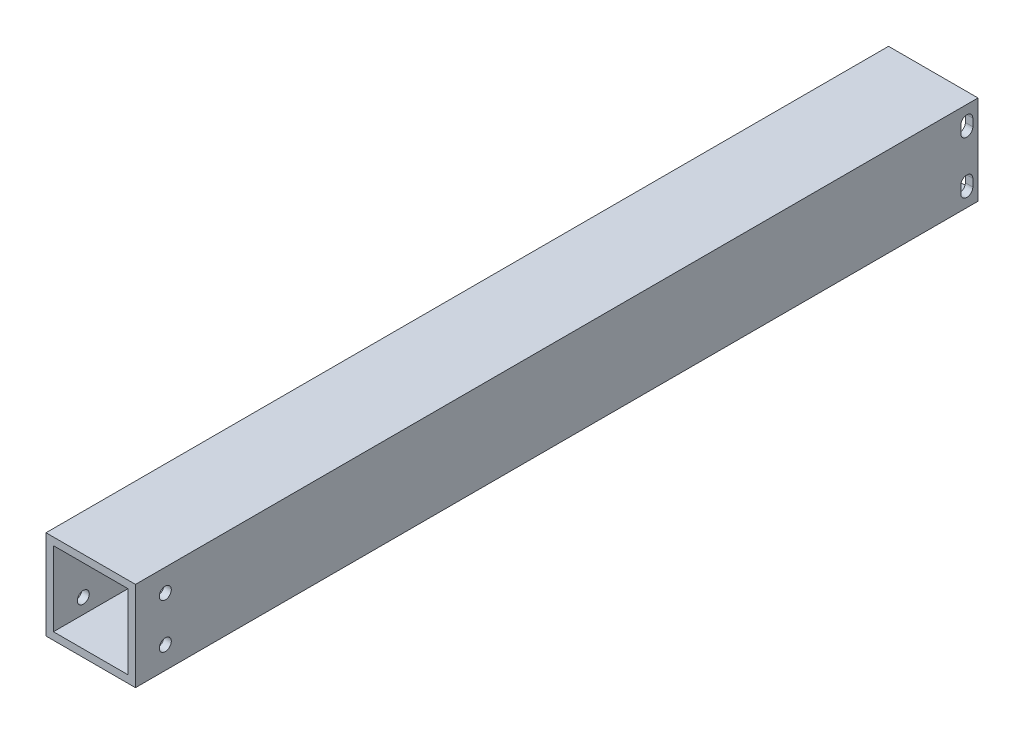
ISO-10303-21;
HEADER;
FILE_DESCRIPTION(('STEP AP214'),'2;1');
FILE_NAME('part.step','',(''),(''),'','','');
FILE_SCHEMA(('AUTOMOTIVE_DESIGN { 1 0 10303 214 1 1 1 1 }'));
ENDSEC;
DATA;
#1=APPLICATION_CONTEXT('core data for automotive mechanical design processes');
#2=APPLICATION_PROTOCOL_DEFINITION('international standard','automotive_design',2000,#1);
#3=PRODUCT_CONTEXT('',#1,'mechanical');
#4=PRODUCT('Part','Part','',(#3));
#5=PRODUCT_RELATED_PRODUCT_CATEGORY('part','',(#4));
#6=PRODUCT_DEFINITION_FORMATION('','',#4);
#7=PRODUCT_DEFINITION_CONTEXT('part definition',#1,'design');
#8=PRODUCT_DEFINITION('design','',#6,#7);
#9=PRODUCT_DEFINITION_SHAPE('','',#8);
#10=(LENGTH_UNIT() NAMED_UNIT(*) SI_UNIT(.MILLI.,.METRE.));
#11=(NAMED_UNIT(*) PLANE_ANGLE_UNIT() SI_UNIT($,.RADIAN.));
#12=(NAMED_UNIT(*) SI_UNIT($,.STERADIAN.) SOLID_ANGLE_UNIT());
#13=UNCERTAINTY_MEASURE_WITH_UNIT(LENGTH_MEASURE(1.E-05),#10,'distance_accuracy_value','');
#14=(GEOMETRIC_REPRESENTATION_CONTEXT(3) GLOBAL_UNCERTAINTY_ASSIGNED_CONTEXT((#13)) GLOBAL_UNIT_ASSIGNED_CONTEXT((#10,
#11,#12)) REPRESENTATION_CONTEXT('',''));
#15=CARTESIAN_POINT('',(0.,0.,0.));
#16=DIRECTION('',(0.,0.,1.));
#17=DIRECTION('',(1.,0.,0.));
#18=AXIS2_PLACEMENT_3D('',#15,#16,#17);
#19=CARTESIAN_POINT('',(0.,31.75,4.7625));
#20=DIRECTION('',(1.,0.,0.));
#21=DIRECTION('',(0.,0.,-1.));
#22=AXIS2_PLACEMENT_3D('',#19,#20,#21);
#23=CYLINDRICAL_SURFACE('',#22,2.5527);
#24=CARTESIAN_POINT('',(0.,31.75,4.7625));
#25=DIRECTION('',(1.,0.,0.));
#26=DIRECTION('',(0.,0.,-1.));
#27=AXIS2_PLACEMENT_3D('',#24,#25,#26);
#28=CIRCLE('',#27,2.5527);
#29=CARTESIAN_POINT('',(0.,31.75,2.2098));
#30=VERTEX_POINT('',#29);
#31=CARTESIAN_POINT('',(0.,31.75,7.31520000000002));
#32=VERTEX_POINT('',#31);
#33=EDGE_CURVE('E274',#30,#32,#28,.T.);
#34=ORIENTED_EDGE('',*,*,#33,.F.);
#35=DIRECTION('',(1.,0.,0.));
#36=VECTOR('',#35,1.);
#37=CARTESIAN_POINT('',(0.,31.75,2.2098));
#38=LINE('',#37,#36);
#39=CARTESIAN_POINT('',(3.1749999999017,31.75,2.2098));
#40=VERTEX_POINT('',#39);
#41=EDGE_CURVE('E188',#30,#40,#38,.T.);
#42=ORIENTED_EDGE('',*,*,#41,.T.);
#43=CARTESIAN_POINT('',(3.1749999999017,31.75,4.7625));
#44=DIRECTION('',(1.,0.,0.));
#45=DIRECTION('',(0.,0.,-1.));
#46=AXIS2_PLACEMENT_3D('',#43,#44,#45);
#47=CIRCLE('',#46,2.5527);
#48=CARTESIAN_POINT('',(3.1749999999017,31.75,7.31520000000001));
#49=VERTEX_POINT('',#48);
#50=EDGE_CURVE('E196',#40,#49,#47,.T.);
#51=ORIENTED_EDGE('',*,*,#50,.T.);
#52=DIRECTION('',(1.,0.,0.));
#53=VECTOR('',#52,1.);
#54=CARTESIAN_POINT('',(0.,31.75,7.31520000000001));
#55=LINE('',#54,#53);
#56=EDGE_CURVE('E217',#49,#32,#55,.F.);
#57=ORIENTED_EDGE('',*,*,#56,.T.);
#58=EDGE_LOOP('',(#34,#42,#51,#57));
#59=FACE_BOUND('',#58,.T.);
#60=ADVANCED_FACE('F17',(#59),#23,.F.);
#61=CARTESIAN_POINT('',(0.,31.75,7.31520000000001));
#62=DIRECTION('',(0.,0.,1.));
#63=DIRECTION('',(0.,-1.,0.));
#64=AXIS2_PLACEMENT_3D('',#61,#62,#63);
#65=PLANE('',#64);
#66=DIRECTION('',(0.,1.,0.));
#67=VECTOR('',#66,1.);
#68=CARTESIAN_POINT('',(0.,38.1,7.31520000000002));
#69=LINE('',#68,#67);
#70=CARTESIAN_POINT('',(0.,28.575,7.31520000000001));
#71=VERTEX_POINT('',#70);
#72=EDGE_CURVE('E273',#32,#71,#69,.F.);
#73=ORIENTED_EDGE('',*,*,#72,.F.);
#74=ORIENTED_EDGE('',*,*,#56,.F.);
#75=DIRECTION('',(0.,-1.,0.));
#76=VECTOR('',#75,1.);
#77=CARTESIAN_POINT('',(3.1749999999017,34.925,7.31520000000001));
#78=LINE('',#77,#76);
#79=CARTESIAN_POINT('',(3.1749999999017,28.575,7.3152));
#80=VERTEX_POINT('',#79);
#81=EDGE_CURVE('E307',#49,#80,#78,.T.);
#82=ORIENTED_EDGE('',*,*,#81,.T.);
#83=DIRECTION('',(1.,0.,0.));
#84=VECTOR('',#83,1.);
#85=CARTESIAN_POINT('',(0.,28.575,7.3152));
#86=LINE('',#85,#84);
#87=EDGE_CURVE('E175',#80,#71,#86,.F.);
#88=ORIENTED_EDGE('',*,*,#87,.T.);
#89=EDGE_LOOP('',(#73,#74,#82,#88));
#90=FACE_BOUND('',#89,.T.);
#91=ADVANCED_FACE('F693',(#90),#65,.F.);
#92=CARTESIAN_POINT('',(0.,28.575,4.7625));
#93=DIRECTION('',(1.,0.,0.));
#94=DIRECTION('',(0.,0.,-1.));
#95=AXIS2_PLACEMENT_3D('',#92,#93,#94);
#96=CYLINDRICAL_SURFACE('',#95,2.5527);
#97=CARTESIAN_POINT('',(0.,28.575,4.7625));
#98=DIRECTION('',(1.,0.,0.));
#99=DIRECTION('',(0.,0.,-1.));
#100=AXIS2_PLACEMENT_3D('',#97,#98,#99);
#101=CIRCLE('',#100,2.5527);
#102=CARTESIAN_POINT('',(0.,28.575,2.20979999999999));
#103=VERTEX_POINT('',#102);
#104=EDGE_CURVE('E271',#71,#103,#101,.T.);
#105=ORIENTED_EDGE('',*,*,#104,.F.);
#106=ORIENTED_EDGE('',*,*,#87,.F.);
#107=CARTESIAN_POINT('',(3.1749999999017,28.575,4.7625));
#108=DIRECTION('',(1.,0.,0.));
#109=DIRECTION('',(0.,0.,-1.));
#110=AXIS2_PLACEMENT_3D('',#107,#108,#109);
#111=CIRCLE('',#110,2.5527);
#112=CARTESIAN_POINT('',(3.1749999999017,28.575,2.2098));
#113=VERTEX_POINT('',#112);
#114=EDGE_CURVE('E20',#80,#113,#111,.T.);
#115=ORIENTED_EDGE('',*,*,#114,.T.);
#116=DIRECTION('',(1.,0.,0.));
#117=VECTOR('',#116,1.);
#118=CARTESIAN_POINT('',(0.,28.575,2.2098));
#119=LINE('',#118,#117);
#120=EDGE_CURVE('E182',#113,#103,#119,.F.);
#121=ORIENTED_EDGE('',*,*,#120,.T.);
#122=EDGE_LOOP('',(#105,#106,#115,#121));
#123=FACE_BOUND('',#122,.T.);
#124=ADVANCED_FACE('F198',(#123),#96,.F.);
#125=CARTESIAN_POINT('',(0.,31.75,2.2098));
#126=DIRECTION('',(0.,0.,-1.));
#127=DIRECTION('',(0.,1.,0.));
#128=AXIS2_PLACEMENT_3D('',#125,#126,#127);
#129=PLANE('',#128);
#130=DIRECTION('',(0.,1.,0.));
#131=VECTOR('',#130,1.);
#132=CARTESIAN_POINT('',(0.,38.1,2.20979999999998));
#133=LINE('',#132,#131);
#134=EDGE_CURVE('E187',#103,#30,#133,.T.);
#135=ORIENTED_EDGE('',*,*,#134,.F.);
#136=ORIENTED_EDGE('',*,*,#120,.F.);
#137=DIRECTION('',(0.,-1.,0.));
#138=VECTOR('',#137,1.);
#139=CARTESIAN_POINT('',(3.1749999999017,34.925,2.2098));
#140=LINE('',#139,#138);
#141=EDGE_CURVE('E185',#113,#40,#140,.F.);
#142=ORIENTED_EDGE('',*,*,#141,.T.);
#143=ORIENTED_EDGE('',*,*,#41,.F.);
#144=EDGE_LOOP('',(#135,#136,#142,#143));
#145=FACE_BOUND('',#144,.T.);
#146=ADVANCED_FACE('F184',(#145),#129,.F.);
#147=CARTESIAN_POINT('',(0.,9.525,346.075));
#148=DIRECTION('',(1.,0.,0.));
#149=DIRECTION('',(0.,0.,-1.));
#150=AXIS2_PLACEMENT_3D('',#147,#148,#149);
#151=CYLINDRICAL_SURFACE('',#150,2.55270000000002);
#152=CARTESIAN_POINT('',(3.1749999999017,9.525,346.075));
#153=DIRECTION('',(1.,0.,0.));
#154=DIRECTION('',(0.,0.,-1.));
#155=AXIS2_PLACEMENT_3D('',#152,#153,#154);
#156=CIRCLE('',#155,2.55270000000002);
#157=CARTESIAN_POINT('',(3.1749999999017,9.525,343.5223));
#158=VERTEX_POINT('',#157);
#159=EDGE_CURVE('E305',#158,#158,#156,.T.);
#160=ORIENTED_EDGE('',*,*,#159,.T.);
#161=EDGE_LOOP('',(#160));
#162=FACE_BOUND('',#161,.T.);
#163=CARTESIAN_POINT('',(0.,9.525,346.075));
#164=DIRECTION('',(1.,0.,0.));
#165=DIRECTION('',(0.,0.,-1.));
#166=AXIS2_PLACEMENT_3D('',#163,#164,#165);
#167=CIRCLE('',#166,2.55270000000002);
#168=CARTESIAN_POINT('',(0.,9.525,343.5223));
#169=VERTEX_POINT('',#168);
#170=EDGE_CURVE('E268',#169,#169,#167,.T.);
#171=ORIENTED_EDGE('',*,*,#170,.F.);
#172=EDGE_LOOP('',(#171));
#173=FACE_BOUND('',#172,.T.);
#174=ADVANCED_FACE('F669',(#162,#173),#151,.F.);
#175=CARTESIAN_POINT('',(0.,28.575,346.075));
#176=DIRECTION('',(1.,0.,0.));
#177=DIRECTION('',(0.,0.,-1.));
#178=AXIS2_PLACEMENT_3D('',#175,#176,#177);
#179=CYLINDRICAL_SURFACE('',#178,2.55270000000002);
#180=CARTESIAN_POINT('',(3.1749999999017,28.575,346.075));
#181=DIRECTION('',(1.,0.,0.));
#182=DIRECTION('',(0.,0.,-1.));
#183=AXIS2_PLACEMENT_3D('',#180,#181,#182);
#184=CIRCLE('',#183,2.55270000000002);
#185=CARTESIAN_POINT('',(3.1749999999017,28.575,343.5223));
#186=VERTEX_POINT('',#185);
#187=EDGE_CURVE('E302',#186,#186,#184,.T.);
#188=ORIENTED_EDGE('',*,*,#187,.T.);
#189=EDGE_LOOP('',(#188));
#190=FACE_BOUND('',#189,.T.);
#191=CARTESIAN_POINT('',(0.,28.575,346.075));
#192=DIRECTION('',(1.,0.,0.));
#193=DIRECTION('',(0.,0.,-1.));
#194=AXIS2_PLACEMENT_3D('',#191,#192,#193);
#195=CIRCLE('',#194,2.55270000000002);
#196=CARTESIAN_POINT('',(0.,28.575,343.5223));
#197=VERTEX_POINT('',#196);
#198=EDGE_CURVE('E265',#197,#197,#195,.T.);
#199=ORIENTED_EDGE('',*,*,#198,.F.);
#200=EDGE_LOOP('',(#199));
#201=FACE_BOUND('',#200,.T.);
#202=ADVANCED_FACE('F661',(#190,#201),#179,.F.);
#203=CARTESIAN_POINT('',(0.,6.34999999999999,4.7625));
#204=DIRECTION('',(1.,0.,0.));
#205=DIRECTION('',(0.,0.,-1.));
#206=AXIS2_PLACEMENT_3D('',#203,#204,#205);
#207=CYLINDRICAL_SURFACE('',#206,2.5527);
#208=CARTESIAN_POINT('',(0.,6.34999999999999,4.7625));
#209=DIRECTION('',(1.,0.,0.));
#210=DIRECTION('',(0.,0.,-1.));
#211=AXIS2_PLACEMENT_3D('',#208,#209,#210);
#212=CIRCLE('',#211,2.5527);
#213=CARTESIAN_POINT('',(0.,6.34999999999999,7.31520000000002));
#214=VERTEX_POINT('',#213);
#215=CARTESIAN_POINT('',(0.,6.34999999999999,2.2098));
#216=VERTEX_POINT('',#215);
#217=EDGE_CURVE('E263',#214,#216,#212,.T.);
#218=ORIENTED_EDGE('',*,*,#217,.F.);
#219=DIRECTION('',(1.,0.,0.));
#220=VECTOR('',#219,1.);
#221=CARTESIAN_POINT('',(0.,6.34999999999999,7.31520000000001));
#222=LINE('',#221,#220);
#223=CARTESIAN_POINT('',(3.1749999999017,6.34999999999999,7.31520000000001));
#224=VERTEX_POINT('',#223);
#225=EDGE_CURVE('E199',#214,#224,#222,.T.);
#226=ORIENTED_EDGE('',*,*,#225,.T.);
#227=CARTESIAN_POINT('',(3.1749999999017,6.34999999999999,4.7625));
#228=DIRECTION('',(1.,0.,0.));
#229=DIRECTION('',(0.,0.,-1.));
#230=AXIS2_PLACEMENT_3D('',#227,#228,#229);
#231=CIRCLE('',#230,2.5527);
#232=CARTESIAN_POINT('',(3.1749999999017,6.34999999999999,2.2098));
#233=VERTEX_POINT('',#232);
#234=EDGE_CURVE('E295',#224,#233,#231,.T.);
#235=ORIENTED_EDGE('',*,*,#234,.T.);
#236=DIRECTION('',(1.,0.,0.));
#237=VECTOR('',#236,1.);
#238=CARTESIAN_POINT('',(0.,6.34999999999999,2.2098));
#239=LINE('',#238,#237);
#240=EDGE_CURVE('E212',#233,#216,#239,.F.);
#241=ORIENTED_EDGE('',*,*,#240,.T.);
#242=EDGE_LOOP('',(#218,#226,#235,#241));
#243=FACE_BOUND('',#242,.T.);
#244=ADVANCED_FACE('F652',(#243),#207,.F.);
#245=CARTESIAN_POINT('',(0.,6.34999999999999,2.2098));
#246=DIRECTION('',(0.,0.,-1.));
#247=DIRECTION('',(0.,1.,0.));
#248=AXIS2_PLACEMENT_3D('',#245,#246,#247);
#249=PLANE('',#248);
#250=DIRECTION('',(0.,1.,0.));
#251=VECTOR('',#250,1.);
#252=CARTESIAN_POINT('',(0.,38.1,2.20979999999998));
#253=LINE('',#252,#251);
#254=CARTESIAN_POINT('',(0.,9.525,2.20979999999999));
#255=VERTEX_POINT('',#254);
#256=EDGE_CURVE('E262',#216,#255,#253,.T.);
#257=ORIENTED_EDGE('',*,*,#256,.F.);
#258=ORIENTED_EDGE('',*,*,#240,.F.);
#259=DIRECTION('',(0.,-1.,0.));
#260=VECTOR('',#259,1.);
#261=CARTESIAN_POINT('',(3.1749999999017,34.925,2.2098));
#262=LINE('',#261,#260);
#263=CARTESIAN_POINT('',(3.1749999999017,9.525,2.2098));
#264=VERTEX_POINT('',#263);
#265=EDGE_CURVE('E297',#233,#264,#262,.F.);
#266=ORIENTED_EDGE('',*,*,#265,.T.);
#267=DIRECTION('',(1.,0.,0.));
#268=VECTOR('',#267,1.);
#269=CARTESIAN_POINT('',(0.,9.525,2.2098));
#270=LINE('',#269,#268);
#271=EDGE_CURVE('E207',#264,#255,#270,.F.);
#272=ORIENTED_EDGE('',*,*,#271,.T.);
#273=EDGE_LOOP('',(#257,#258,#266,#272));
#274=FACE_BOUND('',#273,.T.);
#275=ADVANCED_FACE('F643',(#274),#249,.F.);
#276=CARTESIAN_POINT('',(0.,9.525,4.7625));
#277=DIRECTION('',(1.,0.,0.));
#278=DIRECTION('',(0.,0.,-1.));
#279=AXIS2_PLACEMENT_3D('',#276,#277,#278);
#280=CYLINDRICAL_SURFACE('',#279,2.5527);
#281=CARTESIAN_POINT('',(0.,9.525,4.7625));
#282=DIRECTION('',(1.,0.,0.));
#283=DIRECTION('',(0.,0.,-1.));
#284=AXIS2_PLACEMENT_3D('',#281,#282,#283);
#285=CIRCLE('',#284,2.5527);
#286=CARTESIAN_POINT('',(0.,9.525,7.31520000000002));
#287=VERTEX_POINT('',#286);
#288=EDGE_CURVE('E259',#255,#287,#285,.T.);
#289=ORIENTED_EDGE('',*,*,#288,.F.);
#290=ORIENTED_EDGE('',*,*,#271,.F.);
#291=CARTESIAN_POINT('',(3.1749999999017,9.525,4.7625));
#292=DIRECTION('',(1.,0.,0.));
#293=DIRECTION('',(0.,0.,-1.));
#294=AXIS2_PLACEMENT_3D('',#291,#292,#293);
#295=CIRCLE('',#294,2.5527);
#296=CARTESIAN_POINT('',(3.1749999999017,9.525,7.31520000000001));
#297=VERTEX_POINT('',#296);
#298=EDGE_CURVE('E299',#264,#297,#295,.T.);
#299=ORIENTED_EDGE('',*,*,#298,.T.);
#300=DIRECTION('',(1.,0.,0.));
#301=VECTOR('',#300,1.);
#302=CARTESIAN_POINT('',(0.,9.525,7.31520000000001));
#303=LINE('',#302,#301);
#304=EDGE_CURVE('E200',#297,#287,#303,.F.);
#305=ORIENTED_EDGE('',*,*,#304,.T.);
#306=EDGE_LOOP('',(#289,#290,#299,#305));
#307=FACE_BOUND('',#306,.T.);
#308=ADVANCED_FACE('F634',(#307),#280,.F.);
#309=CARTESIAN_POINT('',(0.,6.34999999999999,7.31520000000001));
#310=DIRECTION('',(0.,0.,1.));
#311=DIRECTION('',(0.,-1.,0.));
#312=AXIS2_PLACEMENT_3D('',#309,#310,#311);
#313=PLANE('',#312);
#314=DIRECTION('',(0.,1.,0.));
#315=VECTOR('',#314,1.);
#316=CARTESIAN_POINT('',(0.,38.1,7.31520000000002));
#317=LINE('',#316,#315);
#318=EDGE_CURVE('E261',#287,#214,#317,.F.);
#319=ORIENTED_EDGE('',*,*,#318,.F.);
#320=ORIENTED_EDGE('',*,*,#304,.F.);
#321=DIRECTION('',(0.,-1.,0.));
#322=VECTOR('',#321,1.);
#323=CARTESIAN_POINT('',(3.1749999999017,34.925,7.31520000000001));
#324=LINE('',#323,#322);
#325=EDGE_CURVE('E298',#297,#224,#324,.T.);
#326=ORIENTED_EDGE('',*,*,#325,.T.);
#327=ORIENTED_EDGE('',*,*,#225,.F.);
#328=EDGE_LOOP('',(#319,#320,#326,#327));
#329=FACE_BOUND('',#328,.T.);
#330=ADVANCED_FACE('F625',(#329),#313,.F.);
#331=CARTESIAN_POINT('',(3.1749999999017,34.925,0.));
#332=DIRECTION('',(-1.,0.,0.));
#333=DIRECTION('',(0.,-1.,0.));
#334=AXIS2_PLACEMENT_3D('',#331,#332,#333);
#335=PLANE('',#334);
#336=DIRECTION('',(0.,0.,-1.));
#337=VECTOR('',#336,1.);
#338=CARTESIAN_POINT('',(3.1749999999017,3.17499999992628,0.));
#339=LINE('',#338,#337);
#340=CARTESIAN_POINT('',(3.1749999999017,3.17499999992628,358.775));
#341=VERTEX_POINT('',#340);
#342=CARTESIAN_POINT('',(3.1749999999017,3.17499999992628,0.));
#343=VERTEX_POINT('',#342);
#344=EDGE_CURVE('E316',#341,#343,#339,.T.);
#345=ORIENTED_EDGE('',*,*,#344,.T.);
#346=DIRECTION('',(0.,1.,0.));
#347=VECTOR('',#346,1.);
#348=CARTESIAN_POINT('',(3.1749999999017,38.1,0.));
#349=LINE('',#348,#347);
#350=CARTESIAN_POINT('',(3.1749999999017,34.925,0.));
#351=VERTEX_POINT('',#350);
#352=EDGE_CURVE('E365',#351,#343,#349,.F.);
#353=ORIENTED_EDGE('',*,*,#352,.F.);
#354=DIRECTION('',(0.,0.,1.));
#355=VECTOR('',#354,1.);
#356=CARTESIAN_POINT('',(3.1749999999017,34.925,0.));
#357=LINE('',#356,#355);
#358=CARTESIAN_POINT('',(3.1749999999017,34.925,358.775));
#359=VERTEX_POINT('',#358);
#360=EDGE_CURVE('E294',#351,#359,#357,.T.);
#361=ORIENTED_EDGE('',*,*,#360,.T.);
#362=DIRECTION('',(0.,1.,0.));
#363=VECTOR('',#362,1.);
#364=CARTESIAN_POINT('',(3.1749999999017,38.1,358.775));
#365=LINE('',#364,#363);
#366=EDGE_CURVE('E342',#341,#359,#365,.T.);
#367=ORIENTED_EDGE('',*,*,#366,.F.);
#368=EDGE_LOOP('',(#345,#353,#361,#367));
#369=FACE_BOUND('',#368,.T.);
#370=ORIENTED_EDGE('',*,*,#234,.F.);
#371=ORIENTED_EDGE('',*,*,#325,.F.);
#372=ORIENTED_EDGE('',*,*,#298,.F.);
#373=ORIENTED_EDGE('',*,*,#265,.F.);
#374=EDGE_LOOP('',(#370,#371,#372,#373));
#375=FACE_BOUND('',#374,.T.);
#376=ORIENTED_EDGE('',*,*,#187,.F.);
#377=EDGE_LOOP('',(#376));
#378=FACE_BOUND('',#377,.T.);
#379=ORIENTED_EDGE('',*,*,#159,.F.);
#380=EDGE_LOOP('',(#379));
#381=FACE_BOUND('',#380,.T.);
#382=ORIENTED_EDGE('',*,*,#50,.F.);
#383=ORIENTED_EDGE('',*,*,#141,.F.);
#384=ORIENTED_EDGE('',*,*,#114,.F.);
#385=ORIENTED_EDGE('',*,*,#81,.F.);
#386=EDGE_LOOP('',(#382,#383,#384,#385));
#387=FACE_BOUND('',#386,.T.);
#388=ADVANCED_FACE('F192',(#369,#375,#378,#381,#387),#335,.F.);
#389=CARTESIAN_POINT('',(3.1749999999017,3.17499999992628,0.));
#390=DIRECTION('',(0.,-1.,0.));
#391=DIRECTION('',(0.,0.,-1.));
#392=AXIS2_PLACEMENT_3D('',#389,#390,#391);
#393=PLANE('',#392);
#394=DIRECTION('',(0.,0.,1.));
#395=VECTOR('',#394,1.);
#396=CARTESIAN_POINT('',(34.925,3.17499999992628,0.));
#397=LINE('',#396,#395);
#398=CARTESIAN_POINT('',(34.925,3.17499999992628,358.775));
#399=VERTEX_POINT('',#398);
#400=CARTESIAN_POINT('',(34.925,3.17499999992628,0.));
#401=VERTEX_POINT('',#400);
#402=EDGE_CURVE('E319',#399,#401,#397,.F.);
#403=ORIENTED_EDGE('',*,*,#402,.T.);
#404=DIRECTION('',(-1.,0.,0.));
#405=VECTOR('',#404,1.);
#406=CARTESIAN_POINT('',(0.,3.17499999992628,0.));
#407=LINE('',#406,#405);
#408=EDGE_CURVE('E367',#343,#401,#407,.F.);
#409=ORIENTED_EDGE('',*,*,#408,.F.);
#410=ORIENTED_EDGE('',*,*,#344,.F.);
#411=DIRECTION('',(1.,0.,0.));
#412=VECTOR('',#411,1.);
#413=CARTESIAN_POINT('',(38.1,3.17499999992628,358.775));
#414=LINE('',#413,#412);
#415=EDGE_CURVE('E352',#399,#341,#414,.F.);
#416=ORIENTED_EDGE('',*,*,#415,.F.);
#417=EDGE_LOOP('',(#403,#409,#410,#416));
#418=FACE_BOUND('',#417,.T.);
#419=ADVANCED_FACE('F444',(#418),#393,.F.);
#420=CARTESIAN_POINT('',(34.925,3.17499999992628,0.));
#421=DIRECTION('',(1.,0.,0.));
#422=DIRECTION('',(0.,1.,0.));
#423=AXIS2_PLACEMENT_3D('',#420,#421,#422);
#424=PLANE('',#423);
#425=DIRECTION('',(0.,0.,1.));
#426=VECTOR('',#425,1.);
#427=CARTESIAN_POINT('',(34.925,34.925,0.));
#428=LINE('',#427,#426);
#429=CARTESIAN_POINT('',(34.925,34.925,358.775));
#430=VERTEX_POINT('',#429);
#431=CARTESIAN_POINT('',(34.925,34.925,0.));
#432=VERTEX_POINT('',#431);
#433=EDGE_CURVE('E322',#430,#432,#428,.F.);
#434=ORIENTED_EDGE('',*,*,#433,.T.);
#435=DIRECTION('',(0.,1.,0.));
#436=VECTOR('',#435,1.);
#437=CARTESIAN_POINT('',(34.925,38.1,0.));
#438=LINE('',#437,#436);
#439=EDGE_CURVE('E369',#401,#432,#438,.T.);
#440=ORIENTED_EDGE('',*,*,#439,.F.);
#441=ORIENTED_EDGE('',*,*,#402,.F.);
#442=DIRECTION('',(0.,1.,0.));
#443=VECTOR('',#442,1.);
#444=CARTESIAN_POINT('',(34.925,38.1,358.775));
#445=LINE('',#444,#443);
#446=EDGE_CURVE('E349',#430,#399,#445,.F.);
#447=ORIENTED_EDGE('',*,*,#446,.F.);
#448=EDGE_LOOP('',(#434,#440,#441,#447));
#449=FACE_BOUND('',#448,.T.);
#450=CARTESIAN_POINT('',(34.925,6.34999999999999,4.7625));
#451=DIRECTION('',(1.,0.,0.));
#452=DIRECTION('',(0.,0.,-1.));
#453=AXIS2_PLACEMENT_3D('',#450,#451,#452);
#454=CIRCLE('',#453,2.5527);
#455=CARTESIAN_POINT('',(34.925,6.34999999999999,7.31520000000001));
#456=VERTEX_POINT('',#455);
#457=CARTESIAN_POINT('',(34.925,6.34999999999999,2.2098));
#458=VERTEX_POINT('',#457);
#459=EDGE_CURVE('E229',#456,#458,#454,.T.);
#460=ORIENTED_EDGE('',*,*,#459,.T.);
#461=DIRECTION('',(0.,1.,0.));
#462=VECTOR('',#461,1.);
#463=CARTESIAN_POINT('',(34.925,6.34999999999999,2.2098));
#464=LINE('',#463,#462);
#465=CARTESIAN_POINT('',(34.925,9.525,2.2098));
#466=VERTEX_POINT('',#465);
#467=EDGE_CURVE('E220',#458,#466,#464,.T.);
#468=ORIENTED_EDGE('',*,*,#467,.T.);
#469=CARTESIAN_POINT('',(34.925,9.525,4.7625));
#470=DIRECTION('',(1.,0.,0.));
#471=DIRECTION('',(0.,0.,-1.));
#472=AXIS2_PLACEMENT_3D('',#469,#470,#471);
#473=CIRCLE('',#472,2.5527);
#474=CARTESIAN_POINT('',(34.925,9.525,7.31520000000001));
#475=VERTEX_POINT('',#474);
#476=EDGE_CURVE('E277',#466,#475,#473,.T.);
#477=ORIENTED_EDGE('',*,*,#476,.T.);
#478=DIRECTION('',(0.,-1.,0.));
#479=VECTOR('',#478,1.);
#480=CARTESIAN_POINT('',(34.925,6.34999999999999,7.31520000000001));
#481=LINE('',#480,#479);
#482=EDGE_CURVE('E225',#475,#456,#481,.T.);
#483=ORIENTED_EDGE('',*,*,#482,.T.);
#484=EDGE_LOOP('',(#460,#468,#477,#483));
#485=FACE_BOUND('',#484,.T.);
#486=CARTESIAN_POINT('',(34.925,28.575,346.075));
#487=DIRECTION('',(1.,0.,0.));
#488=DIRECTION('',(0.,0.,-1.));
#489=AXIS2_PLACEMENT_3D('',#486,#487,#488);
#490=CIRCLE('',#489,2.55270000000002);
#491=CARTESIAN_POINT('',(34.925,28.575,343.5223));
#492=VERTEX_POINT('',#491);
#493=EDGE_CURVE('E282',#492,#492,#490,.T.);
#494=ORIENTED_EDGE('',*,*,#493,.T.);
#495=EDGE_LOOP('',(#494));
#496=FACE_BOUND('',#495,.T.);
#497=CARTESIAN_POINT('',(34.925,9.525,346.075));
#498=DIRECTION('',(1.,0.,0.));
#499=DIRECTION('',(0.,0.,-1.));
#500=AXIS2_PLACEMENT_3D('',#497,#498,#499);
#501=CIRCLE('',#500,2.55270000000002);
#502=CARTESIAN_POINT('',(34.925,9.525,343.5223));
#503=VERTEX_POINT('',#502);
#504=EDGE_CURVE('E285',#503,#503,#501,.T.);
#505=ORIENTED_EDGE('',*,*,#504,.T.);
#506=EDGE_LOOP('',(#505));
#507=FACE_BOUND('',#506,.T.);
#508=CARTESIAN_POINT('',(34.925,31.75,4.7625));
#509=DIRECTION('',(1.,0.,0.));
#510=DIRECTION('',(0.,0.,-1.));
#511=AXIS2_PLACEMENT_3D('',#508,#509,#510);
#512=CIRCLE('',#511,2.5527);
#513=CARTESIAN_POINT('',(34.925,31.75,2.2098));
#514=VERTEX_POINT('',#513);
#515=CARTESIAN_POINT('',(34.925,31.75,7.31520000000001));
#516=VERTEX_POINT('',#515);
#517=EDGE_CURVE('E239',#514,#516,#512,.T.);
#518=ORIENTED_EDGE('',*,*,#517,.T.);
#519=DIRECTION('',(0.,-1.,0.));
#520=VECTOR('',#519,1.);
#521=CARTESIAN_POINT('',(34.925,31.75,7.31520000000001));
#522=LINE('',#521,#520);
#523=CARTESIAN_POINT('',(34.925,28.575,7.31520000000001));
#524=VERTEX_POINT('',#523);
#525=EDGE_CURVE('E230',#516,#524,#522,.T.);
#526=ORIENTED_EDGE('',*,*,#525,.T.);
#527=CARTESIAN_POINT('',(34.925,28.575,4.7625));
#528=DIRECTION('',(1.,0.,0.));
#529=DIRECTION('',(0.,0.,-1.));
#530=AXIS2_PLACEMENT_3D('',#527,#528,#529);
#531=CIRCLE('',#530,2.5527);
#532=CARTESIAN_POINT('',(34.925,28.575,2.2098));
#533=VERTEX_POINT('',#532);
#534=EDGE_CURVE('E289',#524,#533,#531,.T.);
#535=ORIENTED_EDGE('',*,*,#534,.T.);
#536=DIRECTION('',(0.,1.,0.));
#537=VECTOR('',#536,1.);
#538=CARTESIAN_POINT('',(34.925,31.75,2.2098));
#539=LINE('',#538,#537);
#540=EDGE_CURVE('E235',#533,#514,#539,.T.);
#541=ORIENTED_EDGE('',*,*,#540,.T.);
#542=EDGE_LOOP('',(#518,#526,#535,#541));
#543=FACE_BOUND('',#542,.T.);
#544=ADVANCED_FACE('F441',(#449,#485,#496,#507,#543),#424,.F.);
#545=CARTESIAN_POINT('',(34.925,34.925,0.));
#546=DIRECTION('',(0.,1.,0.));
#547=DIRECTION('',(0.,0.,1.));
#548=AXIS2_PLACEMENT_3D('',#545,#546,#547);
#549=PLANE('',#548);
#550=ORIENTED_EDGE('',*,*,#360,.F.);
#551=DIRECTION('',(-1.,0.,0.));
#552=VECTOR('',#551,1.);
#553=CARTESIAN_POINT('',(0.,34.925,0.));
#554=LINE('',#553,#552);
#555=EDGE_CURVE('E371',#432,#351,#554,.T.);
#556=ORIENTED_EDGE('',*,*,#555,.F.);
#557=ORIENTED_EDGE('',*,*,#433,.F.);
#558=DIRECTION('',(1.,0.,0.));
#559=VECTOR('',#558,1.);
#560=CARTESIAN_POINT('',(38.1,34.925,358.775));
#561=LINE('',#560,#559);
#562=EDGE_CURVE('E346',#359,#430,#561,.T.);
#563=ORIENTED_EDGE('',*,*,#562,.F.);
#564=EDGE_LOOP('',(#550,#556,#557,#563));
#565=FACE_BOUND('',#564,.T.);
#566=ADVANCED_FACE('F443',(#565),#549,.F.);
#567=CARTESIAN_POINT('',(0.,31.75,4.7625));
#568=DIRECTION('',(1.,0.,0.));
#569=DIRECTION('',(0.,0.,-1.));
#570=AXIS2_PLACEMENT_3D('',#567,#568,#569);
#571=CYLINDRICAL_SURFACE('',#570,2.5527);
#572=CARTESIAN_POINT('',(38.1,31.75,4.7625));
#573=DIRECTION('',(1.,0.,0.));
#574=DIRECTION('',(0.,0.,-1.));
#575=AXIS2_PLACEMENT_3D('',#572,#573,#574);
#576=CIRCLE('',#575,2.5527);
#577=CARTESIAN_POINT('',(38.1,31.75,7.31520000000001));
#578=VERTEX_POINT('',#577);
#579=CARTESIAN_POINT('',(38.1,31.75,2.2098));
#580=VERTEX_POINT('',#579);
#581=EDGE_CURVE('E256',#578,#580,#576,.F.);
#582=ORIENTED_EDGE('',*,*,#581,.F.);
#583=DIRECTION('',(1.,0.,0.));
#584=VECTOR('',#583,1.);
#585=CARTESIAN_POINT('',(0.,31.75,7.31520000000001));
#586=LINE('',#585,#584);
#587=EDGE_CURVE('E288',#578,#516,#586,.F.);
#588=ORIENTED_EDGE('',*,*,#587,.T.);
#589=ORIENTED_EDGE('',*,*,#517,.F.);
#590=DIRECTION('',(1.,0.,0.));
#591=VECTOR('',#590,1.);
#592=CARTESIAN_POINT('',(0.,31.75,2.2098));
#593=LINE('',#592,#591);
#594=EDGE_CURVE('E238',#514,#580,#593,.T.);
#595=ORIENTED_EDGE('',*,*,#594,.T.);
#596=EDGE_LOOP('',(#582,#588,#589,#595));
#597=FACE_BOUND('',#596,.T.);
#598=ADVANCED_FACE('F436',(#597),#571,.F.);
#599=CARTESIAN_POINT('',(0.,31.75,2.2098));
#600=DIRECTION('',(0.,0.,-1.));
#601=DIRECTION('',(0.,1.,0.));
#602=AXIS2_PLACEMENT_3D('',#599,#600,#601);
#603=PLANE('',#602);
#604=DIRECTION('',(0.,1.,0.));
#605=VECTOR('',#604,1.);
#606=CARTESIAN_POINT('',(38.1,38.1,2.2098));
#607=LINE('',#606,#605);
#608=CARTESIAN_POINT('',(38.1,28.575,2.2098));
#609=VERTEX_POINT('',#608);
#610=EDGE_CURVE('E255',#580,#609,#607,.F.);
#611=ORIENTED_EDGE('',*,*,#610,.F.);
#612=ORIENTED_EDGE('',*,*,#594,.F.);
#613=ORIENTED_EDGE('',*,*,#540,.F.);
#614=DIRECTION('',(1.,0.,0.));
#615=VECTOR('',#614,1.);
#616=CARTESIAN_POINT('',(0.,28.575,2.2098));
#617=LINE('',#616,#615);
#618=EDGE_CURVE('E234',#533,#609,#617,.T.);
#619=ORIENTED_EDGE('',*,*,#618,.T.);
#620=EDGE_LOOP('',(#611,#612,#613,#619));
#621=FACE_BOUND('',#620,.T.);
#622=ADVANCED_FACE('F439',(#621),#603,.F.);
#623=CARTESIAN_POINT('',(0.,28.575,4.7625));
#624=DIRECTION('',(1.,0.,0.));
#625=DIRECTION('',(0.,0.,-1.));
#626=AXIS2_PLACEMENT_3D('',#623,#624,#625);
#627=CYLINDRICAL_SURFACE('',#626,2.5527);
#628=CARTESIAN_POINT('',(38.1,28.575,4.7625));
#629=DIRECTION('',(1.,0.,0.));
#630=DIRECTION('',(0.,0.,-1.));
#631=AXIS2_PLACEMENT_3D('',#628,#629,#630);
#632=CIRCLE('',#631,2.5527);
#633=CARTESIAN_POINT('',(38.1,28.575,7.31520000000001));
#634=VERTEX_POINT('',#633);
#635=EDGE_CURVE('E253',#609,#634,#632,.F.);
#636=ORIENTED_EDGE('',*,*,#635,.F.);
#637=ORIENTED_EDGE('',*,*,#618,.F.);
#638=ORIENTED_EDGE('',*,*,#534,.F.);
#639=DIRECTION('',(1.,0.,0.));
#640=VECTOR('',#639,1.);
#641=CARTESIAN_POINT('',(0.,28.575,7.31520000000001));
#642=LINE('',#641,#640);
#643=EDGE_CURVE('E233',#524,#634,#642,.T.);
#644=ORIENTED_EDGE('',*,*,#643,.T.);
#645=EDGE_LOOP('',(#636,#637,#638,#644));
#646=FACE_BOUND('',#645,.T.);
#647=ADVANCED_FACE('F432',(#646),#627,.F.);
#648=CARTESIAN_POINT('',(0.,31.75,7.31520000000001));
#649=DIRECTION('',(0.,0.,1.));
#650=DIRECTION('',(0.,-1.,0.));
#651=AXIS2_PLACEMENT_3D('',#648,#649,#650);
#652=PLANE('',#651);
#653=DIRECTION('',(0.,1.,0.));
#654=VECTOR('',#653,1.);
#655=CARTESIAN_POINT('',(38.1,38.1,7.31520000000001));
#656=LINE('',#655,#654);
#657=EDGE_CURVE('E252',#634,#578,#656,.T.);
#658=ORIENTED_EDGE('',*,*,#657,.F.);
#659=ORIENTED_EDGE('',*,*,#643,.F.);
#660=ORIENTED_EDGE('',*,*,#525,.F.);
#661=ORIENTED_EDGE('',*,*,#587,.F.);
#662=EDGE_LOOP('',(#658,#659,#660,#661));
#663=FACE_BOUND('',#662,.T.);
#664=ADVANCED_FACE('F434',(#663),#652,.F.);
#665=CARTESIAN_POINT('',(0.,9.525,346.075));
#666=DIRECTION('',(1.,0.,0.));
#667=DIRECTION('',(0.,0.,-1.));
#668=AXIS2_PLACEMENT_3D('',#665,#666,#667);
#669=CYLINDRICAL_SURFACE('',#668,2.55270000000002);
#670=CARTESIAN_POINT('',(38.1,9.525,346.075));
#671=DIRECTION('',(1.,0.,0.));
#672=DIRECTION('',(0.,0.,-1.));
#673=AXIS2_PLACEMENT_3D('',#670,#671,#672);
#674=CIRCLE('',#673,2.55270000000002);
#675=CARTESIAN_POINT('',(38.1,9.525,343.5223));
#676=VERTEX_POINT('',#675);
#677=EDGE_CURVE('E249',#676,#676,#674,.F.);
#678=ORIENTED_EDGE('',*,*,#677,.F.);
#679=EDGE_LOOP('',(#678));
#680=FACE_BOUND('',#679,.T.);
#681=ORIENTED_EDGE('',*,*,#504,.F.);
#682=EDGE_LOOP('',(#681));
#683=FACE_BOUND('',#682,.T.);
#684=ADVANCED_FACE('F491',(#680,#683),#669,.F.);
#685=CARTESIAN_POINT('',(0.,28.575,346.075));
#686=DIRECTION('',(1.,0.,0.));
#687=DIRECTION('',(0.,0.,-1.));
#688=AXIS2_PLACEMENT_3D('',#685,#686,#687);
#689=CYLINDRICAL_SURFACE('',#688,2.55270000000002);
#690=CARTESIAN_POINT('',(38.1,28.575,346.075));
#691=DIRECTION('',(1.,0.,0.));
#692=DIRECTION('',(0.,0.,-1.));
#693=AXIS2_PLACEMENT_3D('',#690,#691,#692);
#694=CIRCLE('',#693,2.55270000000002);
#695=CARTESIAN_POINT('',(38.1,28.575,343.5223));
#696=VERTEX_POINT('',#695);
#697=EDGE_CURVE('E246',#696,#696,#694,.F.);
#698=ORIENTED_EDGE('',*,*,#697,.F.);
#699=EDGE_LOOP('',(#698));
#700=FACE_BOUND('',#699,.T.);
#701=ORIENTED_EDGE('',*,*,#493,.F.);
#702=EDGE_LOOP('',(#701));
#703=FACE_BOUND('',#702,.T.);
#704=ADVANCED_FACE('F487',(#700,#703),#689,.F.);
#705=CARTESIAN_POINT('',(0.,6.34999999999999,4.7625));
#706=DIRECTION('',(1.,0.,0.));
#707=DIRECTION('',(0.,0.,-1.));
#708=AXIS2_PLACEMENT_3D('',#705,#706,#707);
#709=CYLINDRICAL_SURFACE('',#708,2.5527);
#710=CARTESIAN_POINT('',(38.1,6.34999999999999,4.7625));
#711=DIRECTION('',(1.,0.,0.));
#712=DIRECTION('',(0.,0.,-1.));
#713=AXIS2_PLACEMENT_3D('',#710,#711,#712);
#714=CIRCLE('',#713,2.5527);
#715=CARTESIAN_POINT('',(38.1,6.34999999999999,2.2098));
#716=VERTEX_POINT('',#715);
#717=CARTESIAN_POINT('',(38.1,6.34999999999999,7.31520000000001));
#718=VERTEX_POINT('',#717);
#719=EDGE_CURVE('E244',#716,#718,#714,.F.);
#720=ORIENTED_EDGE('',*,*,#719,.F.);
#721=DIRECTION('',(1.,0.,0.));
#722=VECTOR('',#721,1.);
#723=CARTESIAN_POINT('',(0.,6.34999999999999,2.2098));
#724=LINE('',#723,#722);
#725=EDGE_CURVE('E339',#716,#458,#724,.F.);
#726=ORIENTED_EDGE('',*,*,#725,.T.);
#727=ORIENTED_EDGE('',*,*,#459,.F.);
#728=DIRECTION('',(1.,0.,0.));
#729=VECTOR('',#728,1.);
#730=CARTESIAN_POINT('',(0.,6.34999999999999,7.31520000000001));
#731=LINE('',#730,#729);
#732=EDGE_CURVE('E228',#456,#718,#731,.T.);
#733=ORIENTED_EDGE('',*,*,#732,.T.);
#734=EDGE_LOOP('',(#720,#726,#727,#733));
#735=FACE_BOUND('',#734,.T.);
#736=ADVANCED_FACE('F483',(#735),#709,.F.);
#737=CARTESIAN_POINT('',(0.,6.34999999999999,7.31520000000001));
#738=DIRECTION('',(0.,0.,1.));
#739=DIRECTION('',(0.,-1.,0.));
#740=AXIS2_PLACEMENT_3D('',#737,#738,#739);
#741=PLANE('',#740);
#742=DIRECTION('',(0.,1.,0.));
#743=VECTOR('',#742,1.);
#744=CARTESIAN_POINT('',(38.1,38.1,7.31520000000001));
#745=LINE('',#744,#743);
#746=CARTESIAN_POINT('',(38.1,9.525,7.3152));
#747=VERTEX_POINT('',#746);
#748=EDGE_CURVE('E243',#718,#747,#745,.T.);
#749=ORIENTED_EDGE('',*,*,#748,.F.);
#750=ORIENTED_EDGE('',*,*,#732,.F.);
#751=ORIENTED_EDGE('',*,*,#482,.F.);
#752=DIRECTION('',(1.,0.,0.));
#753=VECTOR('',#752,1.);
#754=CARTESIAN_POINT('',(0.,9.525,7.3152));
#755=LINE('',#754,#753);
#756=EDGE_CURVE('E224',#475,#747,#755,.T.);
#757=ORIENTED_EDGE('',*,*,#756,.T.);
#758=EDGE_LOOP('',(#749,#750,#751,#757));
#759=FACE_BOUND('',#758,.T.);
#760=ADVANCED_FACE('F479',(#759),#741,.F.);
#761=CARTESIAN_POINT('',(0.,9.525,4.7625));
#762=DIRECTION('',(1.,0.,0.));
#763=DIRECTION('',(0.,0.,-1.));
#764=AXIS2_PLACEMENT_3D('',#761,#762,#763);
#765=CYLINDRICAL_SURFACE('',#764,2.5527);
#766=CARTESIAN_POINT('',(38.1,9.525,4.7625));
#767=DIRECTION('',(1.,0.,0.));
#768=DIRECTION('',(0.,0.,-1.));
#769=AXIS2_PLACEMENT_3D('',#766,#767,#768);
#770=CIRCLE('',#769,2.5527);
#771=CARTESIAN_POINT('',(38.1,9.525,2.2098));
#772=VERTEX_POINT('',#771);
#773=EDGE_CURVE('E240',#747,#772,#770,.F.);
#774=ORIENTED_EDGE('',*,*,#773,.F.);
#775=ORIENTED_EDGE('',*,*,#756,.F.);
#776=ORIENTED_EDGE('',*,*,#476,.F.);
#777=DIRECTION('',(1.,0.,0.));
#778=VECTOR('',#777,1.);
#779=CARTESIAN_POINT('',(0.,9.525,2.2098));
#780=LINE('',#779,#778);
#781=EDGE_CURVE('E223',#466,#772,#780,.T.);
#782=ORIENTED_EDGE('',*,*,#781,.T.);
#783=EDGE_LOOP('',(#774,#775,#776,#782));
#784=FACE_BOUND('',#783,.T.);
#785=ADVANCED_FACE('F475',(#784),#765,.F.);
#786=CARTESIAN_POINT('',(0.,6.34999999999999,2.2098));
#787=DIRECTION('',(0.,0.,-1.));
#788=DIRECTION('',(0.,1.,0.));
#789=AXIS2_PLACEMENT_3D('',#786,#787,#788);
#790=PLANE('',#789);
#791=DIRECTION('',(0.,1.,0.));
#792=VECTOR('',#791,1.);
#793=CARTESIAN_POINT('',(38.1,38.1,2.2098));
#794=LINE('',#793,#792);
#795=EDGE_CURVE('E242',#772,#716,#794,.F.);
#796=ORIENTED_EDGE('',*,*,#795,.F.);
#797=ORIENTED_EDGE('',*,*,#781,.F.);
#798=ORIENTED_EDGE('',*,*,#467,.F.);
#799=ORIENTED_EDGE('',*,*,#725,.F.);
#800=EDGE_LOOP('',(#796,#797,#798,#799));
#801=FACE_BOUND('',#800,.T.);
#802=ADVANCED_FACE('F471',(#801),#790,.F.);
#803=CARTESIAN_POINT('',(0.,0.,0.));
#804=DIRECTION('',(0.,-1.,0.));
#805=DIRECTION('',(0.,0.,-1.));
#806=AXIS2_PLACEMENT_3D('',#803,#804,#805);
#807=PLANE('',#806);
#808=DIRECTION('',(0.,0.,1.));
#809=VECTOR('',#808,1.);
#810=CARTESIAN_POINT('',(0.,0.,358.775));
#811=LINE('',#810,#809);
#812=CARTESIAN_POINT('',(0.,0.,0.));
#813=VERTEX_POINT('',#812);
#814=CARTESIAN_POINT('',(0.,0.,358.775));
#815=VERTEX_POINT('',#814);
#816=EDGE_CURVE('E361',#813,#815,#811,.T.);
#817=ORIENTED_EDGE('',*,*,#816,.F.);
#818=DIRECTION('',(-1.,0.,0.));
#819=VECTOR('',#818,1.);
#820=CARTESIAN_POINT('',(0.,0.,0.));
#821=LINE('',#820,#819);
#822=CARTESIAN_POINT('',(38.1,0.,0.));
#823=VERTEX_POINT('',#822);
#824=EDGE_CURVE('E374',#823,#813,#821,.T.);
#825=ORIENTED_EDGE('',*,*,#824,.F.);
#826=DIRECTION('',(0.,0.,-1.));
#827=VECTOR('',#826,1.);
#828=CARTESIAN_POINT('',(38.1,0.,0.));
#829=LINE('',#828,#827);
#830=CARTESIAN_POINT('',(38.1,0.,358.775));
#831=VERTEX_POINT('',#830);
#832=EDGE_CURVE('E383',#831,#823,#829,.T.);
#833=ORIENTED_EDGE('',*,*,#832,.F.);
#834=DIRECTION('',(1.,0.,0.));
#835=VECTOR('',#834,1.);
#836=CARTESIAN_POINT('',(38.1,0.,358.775));
#837=LINE('',#836,#835);
#838=EDGE_CURVE('E276',#815,#831,#837,.T.);
#839=ORIENTED_EDGE('',*,*,#838,.F.);
#840=EDGE_LOOP('',(#817,#825,#833,#839));
#841=FACE_BOUND('',#840,.T.);
#842=ADVANCED_FACE('F468',(#841),#807,.T.);
#843=CARTESIAN_POINT('',(38.1,38.1,358.775));
#844=DIRECTION('',(0.,0.,1.));
#845=DIRECTION('',(1.,0.,0.));
#846=AXIS2_PLACEMENT_3D('',#843,#844,#845);
#847=PLANE('',#846);
#848=DIRECTION('',(1.,0.,0.));
#849=VECTOR('',#848,1.);
#850=CARTESIAN_POINT('',(0.,38.1,358.775));
#851=LINE('',#850,#849);
#852=CARTESIAN_POINT('',(38.1,38.1,358.775));
#853=VERTEX_POINT('',#852);
#854=CARTESIAN_POINT('',(0.,38.1,358.775));
#855=VERTEX_POINT('',#854);
#856=EDGE_CURVE('E389',#853,#855,#851,.F.);
#857=ORIENTED_EDGE('',*,*,#856,.T.);
#858=DIRECTION('',(0.,1.,0.));
#859=VECTOR('',#858,1.);
#860=CARTESIAN_POINT('',(0.,38.1,358.775));
#861=LINE('',#860,#859);
#862=EDGE_CURVE('E363',#815,#855,#861,.T.);
#863=ORIENTED_EDGE('',*,*,#862,.F.);
#864=ORIENTED_EDGE('',*,*,#838,.T.);
#865=DIRECTION('',(0.,1.,0.));
#866=VECTOR('',#865,1.);
#867=CARTESIAN_POINT('',(38.1,38.1,358.775));
#868=LINE('',#867,#866);
#869=EDGE_CURVE('E386',#853,#831,#868,.F.);
#870=ORIENTED_EDGE('',*,*,#869,.F.);
#871=EDGE_LOOP('',(#857,#863,#864,#870));
#872=FACE_BOUND('',#871,.T.);
#873=ORIENTED_EDGE('',*,*,#446,.T.);
#874=ORIENTED_EDGE('',*,*,#415,.T.);
#875=ORIENTED_EDGE('',*,*,#366,.T.);
#876=ORIENTED_EDGE('',*,*,#562,.T.);
#877=EDGE_LOOP('',(#873,#874,#875,#876));
#878=FACE_BOUND('',#877,.T.);
#879=ADVANCED_FACE('F411',(#872,#878),#847,.T.);
#880=CARTESIAN_POINT('',(0.,38.1,358.775));
#881=DIRECTION('',(-1.,0.,0.));
#882=DIRECTION('',(0.,0.,1.));
#883=AXIS2_PLACEMENT_3D('',#880,#881,#882);
#884=PLANE('',#883);
#885=DIRECTION('',(0.,0.,-1.));
#886=VECTOR('',#885,1.);
#887=CARTESIAN_POINT('',(0.,38.1,0.));
#888=LINE('',#887,#886);
#889=CARTESIAN_POINT('',(0.,38.1,0.));
#890=VERTEX_POINT('',#889);
#891=EDGE_CURVE('E392',#855,#890,#888,.T.);
#892=ORIENTED_EDGE('',*,*,#891,.T.);
#893=DIRECTION('',(0.,1.,0.));
#894=VECTOR('',#893,1.);
#895=CARTESIAN_POINT('',(0.,38.1,0.));
#896=LINE('',#895,#894);
#897=EDGE_CURVE('E258',#813,#890,#896,.T.);
#898=ORIENTED_EDGE('',*,*,#897,.F.);
#899=ORIENTED_EDGE('',*,*,#816,.T.);
#900=ORIENTED_EDGE('',*,*,#862,.T.);
#901=EDGE_LOOP('',(#892,#898,#899,#900));
#902=FACE_BOUND('',#901,.T.);
#903=ORIENTED_EDGE('',*,*,#288,.T.);
#904=ORIENTED_EDGE('',*,*,#318,.T.);
#905=ORIENTED_EDGE('',*,*,#217,.T.);
#906=ORIENTED_EDGE('',*,*,#256,.T.);
#907=EDGE_LOOP('',(#903,#904,#905,#906));
#908=FACE_BOUND('',#907,.T.);
#909=ORIENTED_EDGE('',*,*,#198,.T.);
#910=EDGE_LOOP('',(#909));
#911=FACE_BOUND('',#910,.T.);
#912=ORIENTED_EDGE('',*,*,#170,.T.);
#913=EDGE_LOOP('',(#912));
#914=FACE_BOUND('',#913,.T.);
#915=ORIENTED_EDGE('',*,*,#104,.T.);
#916=ORIENTED_EDGE('',*,*,#134,.T.);
#917=ORIENTED_EDGE('',*,*,#33,.T.);
#918=ORIENTED_EDGE('',*,*,#72,.T.);
#919=EDGE_LOOP('',(#915,#916,#917,#918));
#920=FACE_BOUND('',#919,.T.);
#921=ADVANCED_FACE('F405',(#902,#908,#911,#914,#920),#884,.T.);
#922=CARTESIAN_POINT('',(0.,38.1,0.));
#923=DIRECTION('',(0.,0.,-1.));
#924=DIRECTION('',(-1.,0.,0.));
#925=AXIS2_PLACEMENT_3D('',#922,#923,#924);
#926=PLANE('',#925);
#927=DIRECTION('',(1.,0.,0.));
#928=VECTOR('',#927,1.);
#929=CARTESIAN_POINT('',(0.,38.1,0.));
#930=LINE('',#929,#928);
#931=CARTESIAN_POINT('',(38.1,38.1,0.));
#932=VERTEX_POINT('',#931);
#933=EDGE_CURVE('E26',#890,#932,#930,.T.);
#934=ORIENTED_EDGE('',*,*,#933,.T.);
#935=DIRECTION('',(0.,1.,0.));
#936=VECTOR('',#935,1.);
#937=CARTESIAN_POINT('',(38.1,38.1,0.));
#938=LINE('',#937,#936);
#939=EDGE_CURVE('E34',#823,#932,#938,.T.);
#940=ORIENTED_EDGE('',*,*,#939,.F.);
#941=ORIENTED_EDGE('',*,*,#824,.T.);
#942=ORIENTED_EDGE('',*,*,#897,.T.);
#943=EDGE_LOOP('',(#934,#940,#941,#942));
#944=FACE_BOUND('',#943,.T.);
#945=ORIENTED_EDGE('',*,*,#439,.T.);
#946=ORIENTED_EDGE('',*,*,#555,.T.);
#947=ORIENTED_EDGE('',*,*,#352,.T.);
#948=ORIENTED_EDGE('',*,*,#408,.T.);
#949=EDGE_LOOP('',(#945,#946,#947,#948));
#950=FACE_BOUND('',#949,.T.);
#951=ADVANCED_FACE('F398',(#944,#950),#926,.T.);
#952=CARTESIAN_POINT('',(38.1,38.1,0.));
#953=DIRECTION('',(1.,0.,0.));
#954=DIRECTION('',(0.,0.,-1.));
#955=AXIS2_PLACEMENT_3D('',#952,#953,#954);
#956=PLANE('',#955);
#957=DIRECTION('',(0.,0.,-1.));
#958=VECTOR('',#957,1.);
#959=CARTESIAN_POINT('',(38.1,38.1,0.));
#960=LINE('',#959,#958);
#961=EDGE_CURVE('E11',#932,#853,#960,.F.);
#962=ORIENTED_EDGE('',*,*,#961,.T.);
#963=ORIENTED_EDGE('',*,*,#869,.T.);
#964=ORIENTED_EDGE('',*,*,#832,.T.);
#965=ORIENTED_EDGE('',*,*,#939,.T.);
#966=EDGE_LOOP('',(#962,#963,#964,#965));
#967=FACE_BOUND('',#966,.T.);
#968=ORIENTED_EDGE('',*,*,#773,.T.);
#969=ORIENTED_EDGE('',*,*,#795,.T.);
#970=ORIENTED_EDGE('',*,*,#719,.T.);
#971=ORIENTED_EDGE('',*,*,#748,.T.);
#972=EDGE_LOOP('',(#968,#969,#970,#971));
#973=FACE_BOUND('',#972,.T.);
#974=ORIENTED_EDGE('',*,*,#697,.T.);
#975=EDGE_LOOP('',(#974));
#976=FACE_BOUND('',#975,.T.);
#977=ORIENTED_EDGE('',*,*,#677,.T.);
#978=EDGE_LOOP('',(#977));
#979=FACE_BOUND('',#978,.T.);
#980=ORIENTED_EDGE('',*,*,#635,.T.);
#981=ORIENTED_EDGE('',*,*,#657,.T.);
#982=ORIENTED_EDGE('',*,*,#581,.T.);
#983=ORIENTED_EDGE('',*,*,#610,.T.);
#984=EDGE_LOOP('',(#980,#981,#982,#983));
#985=FACE_BOUND('',#984,.T.);
#986=ADVANCED_FACE('F415',(#967,#973,#976,#979,#985),#956,.T.);
#987=CARTESIAN_POINT('',(0.,38.1,0.));
#988=DIRECTION('',(0.,-1.,0.));
#989=DIRECTION('',(0.,0.,-1.));
#990=AXIS2_PLACEMENT_3D('',#987,#988,#989);
#991=PLANE('',#990);
#992=ORIENTED_EDGE('',*,*,#933,.F.);
#993=ORIENTED_EDGE('',*,*,#891,.F.);
#994=ORIENTED_EDGE('',*,*,#856,.F.);
#995=ORIENTED_EDGE('',*,*,#961,.F.);
#996=EDGE_LOOP('',(#992,#993,#994,#995));
#997=FACE_BOUND('',#996,.T.);
#998=ADVANCED_FACE('F403',(#997),#991,.F.);
#999=CLOSED_SHELL('',(#60,#91,#124,#146,#174,#202,#244,#275,#308,#330,#388,#419,#544,#566,#598,
#622,#647,#664,#684,#704,#736,#760,#785,#802,#842,#879,#921,#951,#986,#998));
#1000=MANIFOLD_SOLID_BREP('B1',#999);
#1001=ADVANCED_BREP_SHAPE_REPRESENTATION('',(#18,#1000),#14);
#1002=SHAPE_DEFINITION_REPRESENTATION(#9,#1001);
ENDSEC;
END-ISO-10303-21;
